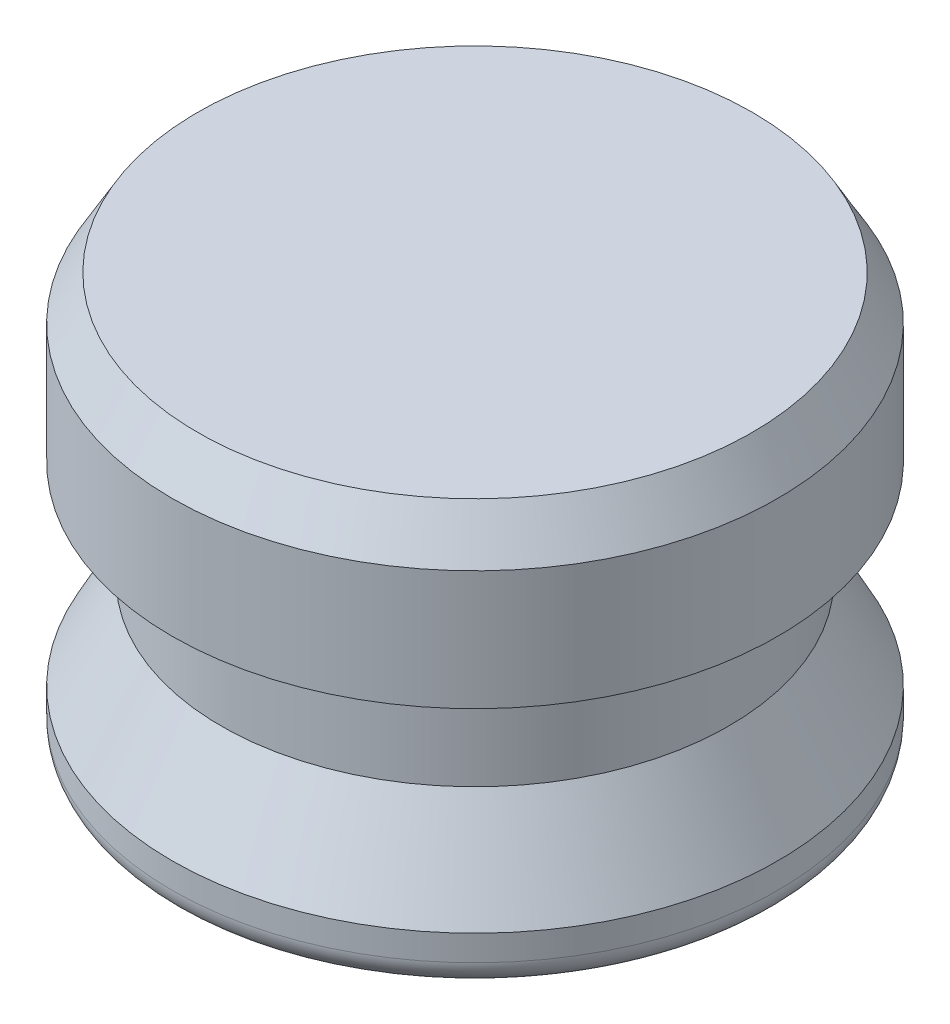
ISO-10303-21;
HEADER;
FILE_DESCRIPTION(('STEP AP214'),'2;1');
FILE_NAME('part.step','',(''),(''),'','','');
FILE_SCHEMA(('AUTOMOTIVE_DESIGN { 1 0 10303 214 1 1 1 1 }'));
ENDSEC;
DATA;
#1=APPLICATION_CONTEXT('core data for automotive mechanical design processes');
#2=APPLICATION_PROTOCOL_DEFINITION('international standard','automotive_design',2000,#1);
#3=PRODUCT_CONTEXT('',#1,'mechanical');
#4=PRODUCT('Part','Part','',(#3));
#5=PRODUCT_RELATED_PRODUCT_CATEGORY('part','',(#4));
#6=PRODUCT_DEFINITION_FORMATION('','',#4);
#7=PRODUCT_DEFINITION_CONTEXT('part definition',#1,'design');
#8=PRODUCT_DEFINITION('design','',#6,#7);
#9=PRODUCT_DEFINITION_SHAPE('','',#8);
#10=(LENGTH_UNIT() NAMED_UNIT(*) SI_UNIT(.MILLI.,.METRE.));
#11=(NAMED_UNIT(*) PLANE_ANGLE_UNIT() SI_UNIT($,.RADIAN.));
#12=(NAMED_UNIT(*) SI_UNIT($,.STERADIAN.) SOLID_ANGLE_UNIT());
#13=UNCERTAINTY_MEASURE_WITH_UNIT(LENGTH_MEASURE(1.E-05),#10,'distance_accuracy_value','');
#14=(GEOMETRIC_REPRESENTATION_CONTEXT(3) GLOBAL_UNCERTAINTY_ASSIGNED_CONTEXT((#13)) GLOBAL_UNIT_ASSIGNED_CONTEXT((#10,
#11,#12)) REPRESENTATION_CONTEXT('',''));
#15=CARTESIAN_POINT('',(0.,0.,0.));
#16=DIRECTION('',(0.,0.,1.));
#17=DIRECTION('',(1.,0.,0.));
#18=AXIS2_PLACEMENT_3D('',#15,#16,#17);
#19=CARTESIAN_POINT('',(0.,0.,0.));
#20=DIRECTION('',(0.,1.,0.));
#21=DIRECTION('',(0.,0.,1.));
#22=AXIS2_PLACEMENT_3D('',#19,#20,#21);
#23=PLANE('',#22);
#24=CARTESIAN_POINT('',(0.,0.,0.));
#25=DIRECTION('',(0.,1.,0.));
#26=DIRECTION('',(0.,0.,1.));
#27=AXIS2_PLACEMENT_3D('',#24,#25,#26);
#28=CIRCLE('',#27,8.60425);
#29=CARTESIAN_POINT('',(0.,0.,8.60425));
#30=VERTEX_POINT('',#29);
#31=EDGE_CURVE('E46',#30,#30,#28,.F.);
#32=ORIENTED_EDGE('',*,*,#31,.T.);
#33=EDGE_LOOP('',(#32));
#34=FACE_BOUND('',#33,.T.);
#35=ADVANCED_FACE('F31',(#34),#23,.F.);
#36=CARTESIAN_POINT('',(0.,0.,0.));
#37=DIRECTION('',(0.,-1.,0.));
#38=DIRECTION('',(0.,0.,-1.));
#39=AXIS2_PLACEMENT_3D('',#36,#37,#38);
#40=CYLINDRICAL_SURFACE('',#39,9.398);
#41=CARTESIAN_POINT('',(0.,0.793749999999999,0.));
#42=DIRECTION('',(0.,1.,0.));
#43=DIRECTION('',(0.,0.,1.));
#44=AXIS2_PLACEMENT_3D('',#41,#42,#43);
#45=CIRCLE('',#44,9.398);
#46=CARTESIAN_POINT('',(0.,0.793749999999999,9.398));
#47=VERTEX_POINT('',#46);
#48=EDGE_CURVE('E42',#47,#47,#45,.T.);
#49=ORIENTED_EDGE('',*,*,#48,.T.);
#50=EDGE_LOOP('',(#49));
#51=FACE_BOUND('',#50,.T.);
#52=CARTESIAN_POINT('',(0.,1.5875,0.));
#53=DIRECTION('',(0.,-1.,0.));
#54=DIRECTION('',(0.,0.,-1.));
#55=AXIS2_PLACEMENT_3D('',#52,#53,#54);
#56=CIRCLE('',#55,9.398);
#57=CARTESIAN_POINT('',(0.,1.5875,-9.398));
#58=VERTEX_POINT('',#57);
#59=EDGE_CURVE('E51',#58,#58,#56,.T.);
#60=ORIENTED_EDGE('',*,*,#59,.T.);
#61=EDGE_LOOP('',(#60));
#62=FACE_BOUND('',#61,.T.);
#63=ADVANCED_FACE('F80',(#51,#62),#40,.T.);
#64=CARTESIAN_POINT('',(0.,4.445,0.));
#65=DIRECTION('',(0.,-1.,0.));
#66=DIRECTION('',(0.,0.,-1.));
#67=AXIS2_PLACEMENT_3D('',#64,#65,#66);
#68=CONICAL_SURFACE('',#67,7.874,0.489957326253729);
#69=ORIENTED_EDGE('',*,*,#59,.F.);
#70=EDGE_LOOP('',(#69));
#71=FACE_BOUND('',#70,.T.);
#72=CARTESIAN_POINT('',(0.,4.445,0.));
#73=DIRECTION('',(0.,-1.,0.));
#74=DIRECTION('',(0.,0.,-1.));
#75=AXIS2_PLACEMENT_3D('',#72,#73,#74);
#76=CIRCLE('',#75,7.874);
#77=CARTESIAN_POINT('',(0.,4.445,-7.874));
#78=VERTEX_POINT('',#77);
#79=EDGE_CURVE('E54',#78,#78,#76,.T.);
#80=ORIENTED_EDGE('',*,*,#79,.T.);
#81=EDGE_LOOP('',(#80));
#82=FACE_BOUND('',#81,.T.);
#83=ADVANCED_FACE('F86',(#71,#82),#68,.T.);
#84=CARTESIAN_POINT('',(0.,0.,0.));
#85=DIRECTION('',(0.,-1.,0.));
#86=DIRECTION('',(0.,0.,-1.));
#87=AXIS2_PLACEMENT_3D('',#84,#85,#86);
#88=CYLINDRICAL_SURFACE('',#87,7.874);
#89=ORIENTED_EDGE('',*,*,#79,.F.);
#90=EDGE_LOOP('',(#89));
#91=FACE_BOUND('',#90,.T.);
#92=CARTESIAN_POINT('',(0.,7.62,0.));
#93=DIRECTION('',(0.,-1.,0.));
#94=DIRECTION('',(0.,0.,-1.));
#95=AXIS2_PLACEMENT_3D('',#92,#93,#94);
#96=CIRCLE('',#95,7.874);
#97=CARTESIAN_POINT('',(0.,7.62,-7.874));
#98=VERTEX_POINT('',#97);
#99=EDGE_CURVE('E57',#98,#98,#96,.T.);
#100=ORIENTED_EDGE('',*,*,#99,.T.);
#101=EDGE_LOOP('',(#100));
#102=FACE_BOUND('',#101,.T.);
#103=ADVANCED_FACE('F76',(#91,#102),#88,.T.);
#104=CARTESIAN_POINT('',(-7.874,7.62,0.));
#105=DIRECTION('',(0.,1.,0.));
#106=DIRECTION('',(0.,0.,1.));
#107=AXIS2_PLACEMENT_3D('',#104,#105,#106);
#108=PLANE('',#107);
#109=ORIENTED_EDGE('',*,*,#99,.F.);
#110=EDGE_LOOP('',(#109));
#111=FACE_BOUND('',#110,.T.);
#112=CARTESIAN_POINT('',(0.,7.62,0.));
#113=DIRECTION('',(0.,-1.,0.));
#114=DIRECTION('',(0.,0.,-1.));
#115=AXIS2_PLACEMENT_3D('',#112,#113,#114);
#116=CIRCLE('',#115,9.398);
#117=CARTESIAN_POINT('',(0.,7.62,-9.398));
#118=VERTEX_POINT('',#117);
#119=EDGE_CURVE('E60',#118,#118,#116,.T.);
#120=ORIENTED_EDGE('',*,*,#119,.T.);
#121=EDGE_LOOP('',(#120));
#122=FACE_BOUND('',#121,.T.);
#123=ADVANCED_FACE('F64',(#111,#122),#108,.F.);
#124=CARTESIAN_POINT('',(0.,0.,0.));
#125=DIRECTION('',(0.,-1.,0.));
#126=DIRECTION('',(0.,0.,-1.));
#127=AXIS2_PLACEMENT_3D('',#124,#125,#126);
#128=CYLINDRICAL_SURFACE('',#127,9.398);
#129=CARTESIAN_POINT('',(0.,11.3251846714922,0.));
#130=DIRECTION('',(0.,-1.,0.));
#131=DIRECTION('',(0.,0.,-1.));
#132=AXIS2_PLACEMENT_3D('',#129,#130,#131);
#133=CIRCLE('',#132,9.398);
#134=CARTESIAN_POINT('',(0.,11.3251846714922,-9.398));
#135=VERTEX_POINT('',#134);
#136=EDGE_CURVE('E38',#135,#135,#133,.T.);
#137=ORIENTED_EDGE('',*,*,#136,.T.);
#138=EDGE_LOOP('',(#137));
#139=FACE_BOUND('',#138,.T.);
#140=ORIENTED_EDGE('',*,*,#119,.F.);
#141=EDGE_LOOP('',(#140));
#142=FACE_BOUND('',#141,.T.);
#143=ADVANCED_FACE('F66',(#139,#142),#128,.T.);
#144=CARTESIAN_POINT('',(-9.398,12.7,0.));
#145=DIRECTION('',(0.,-1.,0.));
#146=DIRECTION('',(0.,0.,-1.));
#147=AXIS2_PLACEMENT_3D('',#144,#145,#146);
#148=PLANE('',#147);
#149=CARTESIAN_POINT('',(0.,12.7,0.));
#150=DIRECTION('',(0.,-1.,0.));
#151=DIRECTION('',(0.,0.,-1.));
#152=AXIS2_PLACEMENT_3D('',#149,#150,#151);
#153=CIRCLE('',#152,8.60424999999999);
#154=CARTESIAN_POINT('',(0.,12.7,-8.60424999999999));
#155=VERTEX_POINT('',#154);
#156=EDGE_CURVE('E10',#155,#155,#153,.F.);
#157=ORIENTED_EDGE('',*,*,#156,.T.);
#158=EDGE_LOOP('',(#157));
#159=FACE_BOUND('',#158,.T.);
#160=ADVANCED_FACE('F68',(#159),#148,.F.);
#161=CARTESIAN_POINT('',(0.,0.793749999999999,0.));
#162=DIRECTION('',(0.,1.,0.));
#163=DIRECTION('',(0.,0.,1.));
#164=AXIS2_PLACEMENT_3D('',#161,#162,#163);
#165=TOROIDAL_SURFACE('',#164,8.60425,0.79375);
#166=ORIENTED_EDGE('',*,*,#48,.F.);
#167=EDGE_LOOP('',(#166));
#168=FACE_BOUND('',#167,.T.);
#169=ORIENTED_EDGE('',*,*,#31,.F.);
#170=EDGE_LOOP('',(#169));
#171=FACE_BOUND('',#170,.T.);
#172=ADVANCED_FACE('F74',(#168,#171),#165,.T.);
#173=CARTESIAN_POINT('',(0.,11.3251846714922,0.));
#174=DIRECTION('',(0.,-1.,0.));
#175=DIRECTION('',(0.,0.,-1.));
#176=AXIS2_PLACEMENT_3D('',#173,#174,#175);
#177=CONICAL_SURFACE('',#176,9.398,0.5235987755983);
#178=ORIENTED_EDGE('',*,*,#156,.F.);
#179=EDGE_LOOP('',(#178));
#180=FACE_BOUND('',#179,.T.);
#181=ORIENTED_EDGE('',*,*,#136,.F.);
#182=EDGE_LOOP('',(#181));
#183=FACE_BOUND('',#182,.T.);
#184=ADVANCED_FACE('F33',(#180,#183),#177,.T.);
#185=CLOSED_SHELL('',(#35,#63,#83,#103,#123,#143,#160,#172,#184));
#186=MANIFOLD_SOLID_BREP('B2',#185);
#187=ADVANCED_BREP_SHAPE_REPRESENTATION('',(#18,#186),#14);
#188=SHAPE_DEFINITION_REPRESENTATION(#9,#187);
ENDSEC;
END-ISO-10303-21;
